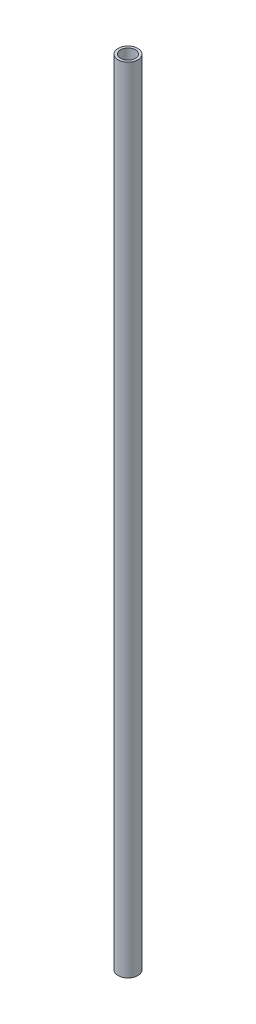
ISO-10303-21;
HEADER;
FILE_DESCRIPTION(('STEP AP214'),'2;1');
FILE_NAME('part.step','',(''),(''),'','','');
FILE_SCHEMA(('AUTOMOTIVE_DESIGN { 1 0 10303 214 1 1 1 1 }'));
ENDSEC;
DATA;
#1=APPLICATION_CONTEXT('core data for automotive mechanical design processes');
#2=APPLICATION_PROTOCOL_DEFINITION('international standard','automotive_design',2000,#1);
#3=PRODUCT_CONTEXT('',#1,'mechanical');
#4=PRODUCT('Part','Part','',(#3));
#5=PRODUCT_RELATED_PRODUCT_CATEGORY('part','',(#4));
#6=PRODUCT_DEFINITION_FORMATION('','',#4);
#7=PRODUCT_DEFINITION_CONTEXT('part definition',#1,'design');
#8=PRODUCT_DEFINITION('design','',#6,#7);
#9=PRODUCT_DEFINITION_SHAPE('','',#8);
#10=(LENGTH_UNIT() NAMED_UNIT(*) SI_UNIT(.MILLI.,.METRE.));
#11=(NAMED_UNIT(*) PLANE_ANGLE_UNIT() SI_UNIT($,.RADIAN.));
#12=(NAMED_UNIT(*) SI_UNIT($,.STERADIAN.) SOLID_ANGLE_UNIT());
#13=UNCERTAINTY_MEASURE_WITH_UNIT(LENGTH_MEASURE(1.E-05),#10,'distance_accuracy_value','');
#14=(GEOMETRIC_REPRESENTATION_CONTEXT(3) GLOBAL_UNCERTAINTY_ASSIGNED_CONTEXT((#13)) GLOBAL_UNIT_ASSIGNED_CONTEXT((#10,
#11,#12)) REPRESENTATION_CONTEXT('',''));
#15=CARTESIAN_POINT('',(0.,0.,0.));
#16=DIRECTION('',(0.,0.,1.));
#17=DIRECTION('',(1.,0.,0.));
#18=AXIS2_PLACEMENT_3D('',#15,#16,#17);
#19=CARTESIAN_POINT('',(0.,160.,0.));
#20=DIRECTION('',(0.,1.,0.));
#21=DIRECTION('',(0.,0.,1.));
#22=AXIS2_PLACEMENT_3D('',#19,#20,#21);
#23=PLANE('',#22);
#24=CARTESIAN_POINT('',(0.,160.,0.));
#25=DIRECTION('',(0.,1.,0.));
#26=DIRECTION('',(0.,0.,1.));
#27=AXIS2_PLACEMENT_3D('',#24,#25,#26);
#28=CIRCLE('',#27,2.);
#29=CARTESIAN_POINT('',(0.,160.,2.));
#30=VERTEX_POINT('',#29);
#31=EDGE_CURVE('E10',#30,#30,#28,.T.);
#32=ORIENTED_EDGE('',*,*,#31,.T.);
#33=EDGE_LOOP('',(#32));
#34=FACE_BOUND('',#33,.T.);
#35=CARTESIAN_POINT('',(0.,160.,0.));
#36=DIRECTION('',(0.,1.,0.));
#37=DIRECTION('',(0.,0.,1.));
#38=AXIS2_PLACEMENT_3D('',#35,#36,#37);
#39=CIRCLE('',#38,1.5);
#40=CARTESIAN_POINT('',(0.,160.,1.5));
#41=VERTEX_POINT('',#40);
#42=EDGE_CURVE('E44',#41,#41,#39,.T.);
#43=ORIENTED_EDGE('',*,*,#42,.F.);
#44=EDGE_LOOP('',(#43));
#45=FACE_BOUND('',#44,.T.);
#46=ADVANCED_FACE('F33',(#34,#45),#23,.T.);
#47=CARTESIAN_POINT('',(0.,0.,0.));
#48=DIRECTION('',(0.,1.,0.));
#49=DIRECTION('',(0.,0.,1.));
#50=AXIS2_PLACEMENT_3D('',#47,#48,#49);
#51=PLANE('',#50);
#52=CARTESIAN_POINT('',(0.,0.,0.));
#53=DIRECTION('',(0.,1.,0.));
#54=DIRECTION('',(0.,0.,1.));
#55=AXIS2_PLACEMENT_3D('',#52,#53,#54);
#56=CIRCLE('',#55,2.);
#57=CARTESIAN_POINT('',(0.,0.,2.));
#58=VERTEX_POINT('',#57);
#59=EDGE_CURVE('E37',#58,#58,#56,.T.);
#60=ORIENTED_EDGE('',*,*,#59,.F.);
#61=EDGE_LOOP('',(#60));
#62=FACE_BOUND('',#61,.T.);
#63=CARTESIAN_POINT('',(0.,0.,0.));
#64=DIRECTION('',(0.,1.,0.));
#65=DIRECTION('',(0.,0.,1.));
#66=AXIS2_PLACEMENT_3D('',#63,#64,#65);
#67=CIRCLE('',#66,1.5);
#68=CARTESIAN_POINT('',(0.,0.,1.5));
#69=VERTEX_POINT('',#68);
#70=EDGE_CURVE('E46',#69,#69,#67,.T.);
#71=ORIENTED_EDGE('',*,*,#70,.T.);
#72=EDGE_LOOP('',(#71));
#73=FACE_BOUND('',#72,.T.);
#74=ADVANCED_FACE('F56',(#62,#73),#51,.F.);
#75=CARTESIAN_POINT('',(0.,160.,0.));
#76=DIRECTION('',(0.,-1.,0.));
#77=DIRECTION('',(0.,0.,-1.));
#78=AXIS2_PLACEMENT_3D('',#75,#76,#77);
#79=CYLINDRICAL_SURFACE('',#78,2.);
#80=ORIENTED_EDGE('',*,*,#31,.F.);
#81=EDGE_LOOP('',(#80));
#82=FACE_BOUND('',#81,.T.);
#83=ORIENTED_EDGE('',*,*,#59,.T.);
#84=EDGE_LOOP('',(#83));
#85=FACE_BOUND('',#84,.T.);
#86=ADVANCED_FACE('F35',(#82,#85),#79,.T.);
#87=CARTESIAN_POINT('',(0.,160.,0.));
#88=DIRECTION('',(0.,-1.,0.));
#89=DIRECTION('',(0.,0.,-1.));
#90=AXIS2_PLACEMENT_3D('',#87,#88,#89);
#91=CYLINDRICAL_SURFACE('',#90,1.5);
#92=ORIENTED_EDGE('',*,*,#42,.T.);
#93=EDGE_LOOP('',(#92));
#94=FACE_BOUND('',#93,.T.);
#95=ORIENTED_EDGE('',*,*,#70,.F.);
#96=EDGE_LOOP('',(#95));
#97=FACE_BOUND('',#96,.T.);
#98=ADVANCED_FACE('F52',(#94,#97),#91,.F.);
#99=CLOSED_SHELL('',(#46,#74,#86,#98));
#100=MANIFOLD_SOLID_BREP('B2',#99);
#101=ADVANCED_BREP_SHAPE_REPRESENTATION('',(#18,#100),#14);
#102=SHAPE_DEFINITION_REPRESENTATION(#9,#101);
ENDSEC;
END-ISO-10303-21;
